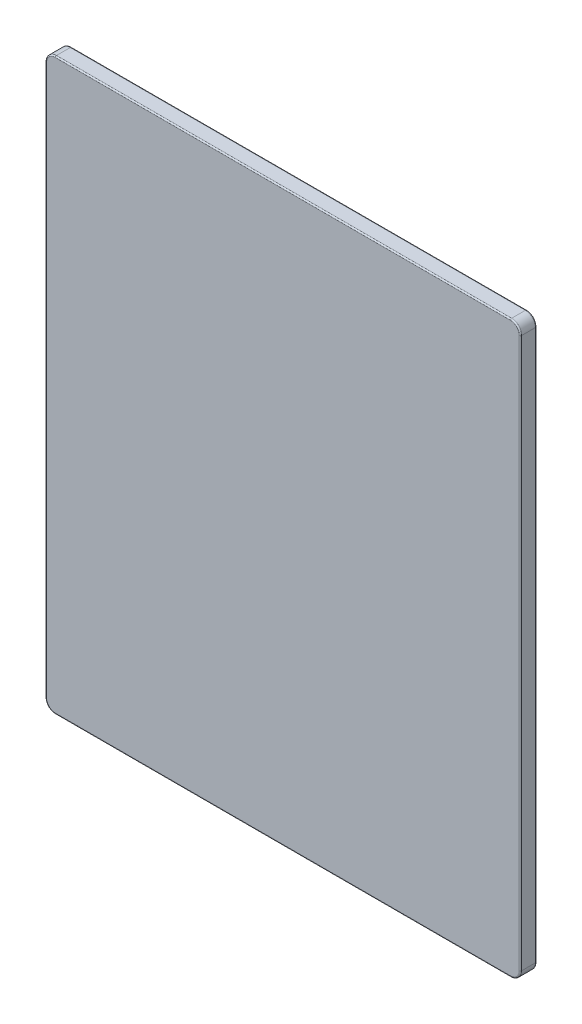
ISO-10303-21;
HEADER;
FILE_DESCRIPTION(('STEP AP214'),'2;1');
FILE_NAME('part.step','',(''),(''),'','','');
FILE_SCHEMA(('AUTOMOTIVE_DESIGN { 1 0 10303 214 1 1 1 1 }'));
ENDSEC;
DATA;
#1=APPLICATION_CONTEXT('core data for automotive mechanical design processes');
#2=APPLICATION_PROTOCOL_DEFINITION('international standard','automotive_design',2000,#1);
#3=PRODUCT_CONTEXT('',#1,'mechanical');
#4=PRODUCT('Part','Part','',(#3));
#5=PRODUCT_RELATED_PRODUCT_CATEGORY('part','',(#4));
#6=PRODUCT_DEFINITION_FORMATION('','',#4);
#7=PRODUCT_DEFINITION_CONTEXT('part definition',#1,'design');
#8=PRODUCT_DEFINITION('design','',#6,#7);
#9=PRODUCT_DEFINITION_SHAPE('','',#8);
#10=(LENGTH_UNIT() NAMED_UNIT(*) SI_UNIT(.MILLI.,.METRE.));
#11=(NAMED_UNIT(*) PLANE_ANGLE_UNIT() SI_UNIT($,.RADIAN.));
#12=(NAMED_UNIT(*) SI_UNIT($,.STERADIAN.) SOLID_ANGLE_UNIT());
#13=UNCERTAINTY_MEASURE_WITH_UNIT(LENGTH_MEASURE(1.E-05),#10,'distance_accuracy_value','');
#14=(GEOMETRIC_REPRESENTATION_CONTEXT(3) GLOBAL_UNCERTAINTY_ASSIGNED_CONTEXT((#13)) GLOBAL_UNIT_ASSIGNED_CONTEXT((#10,
#11,#12)) REPRESENTATION_CONTEXT('',''));
#15=CARTESIAN_POINT('',(0.,0.,0.));
#16=DIRECTION('',(0.,0.,1.));
#17=DIRECTION('',(1.,0.,0.));
#18=AXIS2_PLACEMENT_3D('',#15,#16,#17);
#19=CARTESIAN_POINT('',(0.,0.,13.));
#20=DIRECTION('',(0.,0.,-1.));
#21=DIRECTION('',(-1.,0.,0.));
#22=AXIS2_PLACEMENT_3D('',#19,#20,#21);
#23=PLANE('',#22);
#24=CARTESIAN_POINT('',(182.5,-220.6,13.));
#25=DIRECTION('',(0.,0.,-1.));
#26=DIRECTION('',(1.,0.,0.));
#27=AXIS2_PLACEMENT_3D('',#24,#25,#26);
#28=CIRCLE('',#27,7.00000000000001);
#29=CARTESIAN_POINT('',(189.5,-220.6,13.));
#30=VERTEX_POINT('',#29);
#31=CARTESIAN_POINT('',(182.5,-227.6,13.));
#32=VERTEX_POINT('',#31);
#33=EDGE_CURVE('E210',#30,#32,#28,.T.);
#34=ORIENTED_EDGE('',*,*,#33,.F.);
#35=DIRECTION('',(0.,1.,0.));
#36=VECTOR('',#35,1.);
#37=CARTESIAN_POINT('',(189.5,0.,13.));
#38=LINE('',#37,#36);
#39=CARTESIAN_POINT('',(189.5,220.6,13.));
#40=VERTEX_POINT('',#39);
#41=EDGE_CURVE('E234',#40,#30,#38,.F.);
#42=ORIENTED_EDGE('',*,*,#41,.F.);
#43=CARTESIAN_POINT('',(182.5,220.6,13.));
#44=DIRECTION('',(0.,0.,-1.));
#45=DIRECTION('',(0.,1.,0.));
#46=AXIS2_PLACEMENT_3D('',#43,#44,#45);
#47=CIRCLE('',#46,7.00000000000001);
#48=CARTESIAN_POINT('',(182.5,227.6,13.));
#49=VERTEX_POINT('',#48);
#50=EDGE_CURVE('E247',#49,#40,#47,.T.);
#51=ORIENTED_EDGE('',*,*,#50,.F.);
#52=DIRECTION('',(-1.,0.,0.));
#53=VECTOR('',#52,1.);
#54=CARTESIAN_POINT('',(0.,227.6,13.));
#55=LINE('',#54,#53);
#56=CARTESIAN_POINT('',(-182.5,227.6,13.));
#57=VERTEX_POINT('',#56);
#58=EDGE_CURVE('E145',#57,#49,#55,.F.);
#59=ORIENTED_EDGE('',*,*,#58,.F.);
#60=CARTESIAN_POINT('',(-182.5,220.6,13.));
#61=DIRECTION('',(0.,0.,-1.));
#62=DIRECTION('',(-1.,0.,0.));
#63=AXIS2_PLACEMENT_3D('',#60,#61,#62);
#64=CIRCLE('',#63,7.00000000000001);
#65=CARTESIAN_POINT('',(-189.5,220.6,13.));
#66=VERTEX_POINT('',#65);
#67=EDGE_CURVE('E141',#66,#57,#64,.T.);
#68=ORIENTED_EDGE('',*,*,#67,.F.);
#69=DIRECTION('',(0.,-1.,0.));
#70=VECTOR('',#69,1.);
#71=CARTESIAN_POINT('',(-189.5,0.,13.));
#72=LINE('',#71,#70);
#73=CARTESIAN_POINT('',(-189.5,-220.6,13.));
#74=VERTEX_POINT('',#73);
#75=EDGE_CURVE('E128',#74,#66,#72,.F.);
#76=ORIENTED_EDGE('',*,*,#75,.F.);
#77=CARTESIAN_POINT('',(-182.5,-220.6,13.));
#78=DIRECTION('',(0.,0.,-1.));
#79=DIRECTION('',(0.,-1.,0.));
#80=AXIS2_PLACEMENT_3D('',#77,#78,#79);
#81=CIRCLE('',#80,7.00000000000001);
#82=CARTESIAN_POINT('',(-182.5,-227.6,13.));
#83=VERTEX_POINT('',#82);
#84=EDGE_CURVE('E164',#83,#74,#81,.T.);
#85=ORIENTED_EDGE('',*,*,#84,.F.);
#86=DIRECTION('',(1.,0.,0.));
#87=VECTOR('',#86,1.);
#88=CARTESIAN_POINT('',(0.,-227.6,13.));
#89=LINE('',#88,#87);
#90=EDGE_CURVE('E173',#32,#83,#89,.F.);
#91=ORIENTED_EDGE('',*,*,#90,.F.);
#92=EDGE_LOOP('',(#34,#42,#51,#59,#68,#76,#85,#91));
#93=FACE_BOUND('',#92,.T.);
#94=ADVANCED_FACE('F16',(#93),#23,.F.);
#95=CARTESIAN_POINT('',(-189.5,0.,12.));
#96=DIRECTION('',(0.,-1.,0.));
#97=DIRECTION('',(0.,0.,-1.));
#98=AXIS2_PLACEMENT_3D('',#95,#96,#97);
#99=CYLINDRICAL_SURFACE('',#98,1.);
#100=CARTESIAN_POINT('',(-189.5,-220.6,12.));
#101=DIRECTION('',(0.,1.,0.));
#102=DIRECTION('',(-1.,0.,0.));
#103=AXIS2_PLACEMENT_3D('',#100,#101,#102);
#104=CIRCLE('',#103,1.);
#105=CARTESIAN_POINT('',(-190.5,-220.6,12.));
#106=VERTEX_POINT('',#105);
#107=EDGE_CURVE('E135',#74,#106,#104,.F.);
#108=ORIENTED_EDGE('',*,*,#107,.F.);
#109=ORIENTED_EDGE('',*,*,#75,.T.);
#110=CARTESIAN_POINT('',(-189.5,220.6,12.));
#111=DIRECTION('',(0.,1.,0.));
#112=DIRECTION('',(-1.,0.,0.));
#113=AXIS2_PLACEMENT_3D('',#110,#111,#112);
#114=CIRCLE('',#113,1.);
#115=CARTESIAN_POINT('',(-190.5,220.6,12.));
#116=VERTEX_POINT('',#115);
#117=EDGE_CURVE('E132',#116,#66,#114,.T.);
#118=ORIENTED_EDGE('',*,*,#117,.F.);
#119=DIRECTION('',(0.,1.,0.));
#120=VECTOR('',#119,1.);
#121=CARTESIAN_POINT('',(-190.5,-228.6,12.));
#122=LINE('',#121,#120);
#123=EDGE_CURVE('E177',#116,#106,#122,.F.);
#124=ORIENTED_EDGE('',*,*,#123,.T.);
#125=EDGE_LOOP('',(#108,#109,#118,#124));
#126=FACE_BOUND('',#125,.T.);
#127=ADVANCED_FACE('F130',(#126),#99,.T.);
#128=CARTESIAN_POINT('',(-182.5,220.6,12.));
#129=DIRECTION('',(0.,0.,-1.));
#130=DIRECTION('',(-1.,0.,0.));
#131=AXIS2_PLACEMENT_3D('',#128,#129,#130);
#132=TOROIDAL_SURFACE('',#131,7.00000000000001,1.);
#133=ORIENTED_EDGE('',*,*,#117,.T.);
#134=ORIENTED_EDGE('',*,*,#67,.T.);
#135=CARTESIAN_POINT('',(-182.5,227.6,12.));
#136=DIRECTION('',(-1.,0.,0.));
#137=DIRECTION('',(0.,0.,1.));
#138=AXIS2_PLACEMENT_3D('',#135,#136,#137);
#139=CIRCLE('',#138,1.);
#140=CARTESIAN_POINT('',(-182.5,228.6,12.));
#141=VERTEX_POINT('',#140);
#142=EDGE_CURVE('E148',#141,#57,#139,.F.);
#143=ORIENTED_EDGE('',*,*,#142,.F.);
#144=CARTESIAN_POINT('',(-182.5,220.6,12.));
#145=DIRECTION('',(0.,0.,-1.));
#146=DIRECTION('',(-1.,0.,0.));
#147=AXIS2_PLACEMENT_3D('',#144,#145,#146);
#148=CIRCLE('',#147,8.00000000000001);
#149=EDGE_CURVE('E154',#116,#141,#148,.T.);
#150=ORIENTED_EDGE('',*,*,#149,.F.);
#151=EDGE_LOOP('',(#133,#134,#143,#150));
#152=FACE_BOUND('',#151,.T.);
#153=ADVANCED_FACE('F152',(#152),#132,.T.);
#154=CARTESIAN_POINT('',(0.,227.6,12.));
#155=DIRECTION('',(-1.,0.,0.));
#156=DIRECTION('',(0.,0.,1.));
#157=AXIS2_PLACEMENT_3D('',#154,#155,#156);
#158=CYLINDRICAL_SURFACE('',#157,1.);
#159=CARTESIAN_POINT('',(182.5,227.6,12.));
#160=DIRECTION('',(1.,0.,0.));
#161=DIRECTION('',(0.,1.,0.));
#162=AXIS2_PLACEMENT_3D('',#159,#160,#161);
#163=CIRCLE('',#162,1.);
#164=CARTESIAN_POINT('',(182.5,228.6,12.));
#165=VERTEX_POINT('',#164);
#166=EDGE_CURVE('E269',#165,#49,#163,.T.);
#167=ORIENTED_EDGE('',*,*,#166,.F.);
#168=DIRECTION('',(1.,0.,0.));
#169=VECTOR('',#168,1.);
#170=CARTESIAN_POINT('',(-190.5,228.6,12.));
#171=LINE('',#170,#169);
#172=EDGE_CURVE('E273',#165,#141,#171,.F.);
#173=ORIENTED_EDGE('',*,*,#172,.T.);
#174=ORIENTED_EDGE('',*,*,#142,.T.);
#175=ORIENTED_EDGE('',*,*,#58,.T.);
#176=EDGE_LOOP('',(#167,#173,#174,#175));
#177=FACE_BOUND('',#176,.T.);
#178=ADVANCED_FACE('F263',(#177),#158,.T.);
#179=CARTESIAN_POINT('',(182.5,220.6,12.));
#180=DIRECTION('',(0.,0.,-1.));
#181=DIRECTION('',(-1.,0.,0.));
#182=AXIS2_PLACEMENT_3D('',#179,#180,#181);
#183=TOROIDAL_SURFACE('',#182,7.00000000000001,1.);
#184=CARTESIAN_POINT('',(189.5,220.6,12.));
#185=DIRECTION('',(0.,1.,0.));
#186=DIRECTION('',(0.,0.,1.));
#187=AXIS2_PLACEMENT_3D('',#184,#185,#186);
#188=CIRCLE('',#187,1.);
#189=CARTESIAN_POINT('',(190.5,220.6,12.));
#190=VERTEX_POINT('',#189);
#191=EDGE_CURVE('E241',#190,#40,#188,.F.);
#192=ORIENTED_EDGE('',*,*,#191,.F.);
#193=CARTESIAN_POINT('',(182.5,220.6,12.));
#194=DIRECTION('',(0.,0.,-1.));
#195=DIRECTION('',(-1.,0.,0.));
#196=AXIS2_PLACEMENT_3D('',#193,#194,#195);
#197=CIRCLE('',#196,8.00000000000001);
#198=EDGE_CURVE('E290',#165,#190,#197,.T.);
#199=ORIENTED_EDGE('',*,*,#198,.F.);
#200=ORIENTED_EDGE('',*,*,#166,.T.);
#201=ORIENTED_EDGE('',*,*,#50,.T.);
#202=EDGE_LOOP('',(#192,#199,#200,#201));
#203=FACE_BOUND('',#202,.T.);
#204=ADVANCED_FACE('F253',(#203),#183,.T.);
#205=CARTESIAN_POINT('',(189.5,0.,12.));
#206=DIRECTION('',(0.,1.,0.));
#207=DIRECTION('',(0.,0.,1.));
#208=AXIS2_PLACEMENT_3D('',#205,#206,#207);
#209=CYLINDRICAL_SURFACE('',#208,1.);
#210=CARTESIAN_POINT('',(189.5,-220.6,12.));
#211=DIRECTION('',(0.,-1.,0.));
#212=DIRECTION('',(1.,0.,0.));
#213=AXIS2_PLACEMENT_3D('',#210,#211,#212);
#214=CIRCLE('',#213,1.);
#215=CARTESIAN_POINT('',(190.5,-220.6,12.));
#216=VERTEX_POINT('',#215);
#217=EDGE_CURVE('E215',#216,#30,#214,.T.);
#218=ORIENTED_EDGE('',*,*,#217,.F.);
#219=DIRECTION('',(0.,1.,0.));
#220=VECTOR('',#219,1.);
#221=CARTESIAN_POINT('',(190.5,-228.6,12.));
#222=LINE('',#221,#220);
#223=EDGE_CURVE('E295',#216,#190,#222,.T.);
#224=ORIENTED_EDGE('',*,*,#223,.T.);
#225=ORIENTED_EDGE('',*,*,#191,.T.);
#226=ORIENTED_EDGE('',*,*,#41,.T.);
#227=EDGE_LOOP('',(#218,#224,#225,#226));
#228=FACE_BOUND('',#227,.T.);
#229=ADVANCED_FACE('F224',(#228),#209,.T.);
#230=CARTESIAN_POINT('',(182.5,-220.6,12.));
#231=DIRECTION('',(0.,0.,-1.));
#232=DIRECTION('',(-1.,0.,0.));
#233=AXIS2_PLACEMENT_3D('',#230,#231,#232);
#234=TOROIDAL_SURFACE('',#233,7.00000000000001,1.);
#235=ORIENTED_EDGE('',*,*,#217,.T.);
#236=ORIENTED_EDGE('',*,*,#33,.T.);
#237=CARTESIAN_POINT('',(182.5,-227.6,12.));
#238=DIRECTION('',(1.,0.,0.));
#239=DIRECTION('',(0.,0.,-1.));
#240=AXIS2_PLACEMENT_3D('',#237,#238,#239);
#241=CIRCLE('',#240,1.);
#242=CARTESIAN_POINT('',(182.5,-228.6,12.));
#243=VERTEX_POINT('',#242);
#244=EDGE_CURVE('E208',#243,#32,#241,.F.);
#245=ORIENTED_EDGE('',*,*,#244,.F.);
#246=CARTESIAN_POINT('',(182.5,-220.6,12.));
#247=DIRECTION('',(0.,0.,-1.));
#248=DIRECTION('',(-1.,0.,0.));
#249=AXIS2_PLACEMENT_3D('',#246,#247,#248);
#250=CIRCLE('',#249,8.00000000000001);
#251=EDGE_CURVE('E201',#216,#243,#250,.T.);
#252=ORIENTED_EDGE('',*,*,#251,.F.);
#253=EDGE_LOOP('',(#235,#236,#245,#252));
#254=FACE_BOUND('',#253,.T.);
#255=ADVANCED_FACE('F218',(#254),#234,.T.);
#256=CARTESIAN_POINT('',(0.,-227.6,12.));
#257=DIRECTION('',(1.,0.,0.));
#258=DIRECTION('',(0.,0.,-1.));
#259=AXIS2_PLACEMENT_3D('',#256,#257,#258);
#260=CYLINDRICAL_SURFACE('',#259,1.);
#261=ORIENTED_EDGE('',*,*,#244,.T.);
#262=ORIENTED_EDGE('',*,*,#90,.T.);
#263=CARTESIAN_POINT('',(-182.5,-227.6,12.));
#264=DIRECTION('',(-1.,0.,0.));
#265=DIRECTION('',(0.,-1.,0.));
#266=AXIS2_PLACEMENT_3D('',#263,#264,#265);
#267=CIRCLE('',#266,1.);
#268=CARTESIAN_POINT('',(-182.5,-228.6,12.));
#269=VERTEX_POINT('',#268);
#270=EDGE_CURVE('E178',#269,#83,#267,.T.);
#271=ORIENTED_EDGE('',*,*,#270,.F.);
#272=DIRECTION('',(1.,0.,0.));
#273=VECTOR('',#272,1.);
#274=CARTESIAN_POINT('',(-190.5,-228.6,12.));
#275=LINE('',#274,#273);
#276=EDGE_CURVE('E204',#269,#243,#275,.T.);
#277=ORIENTED_EDGE('',*,*,#276,.T.);
#278=EDGE_LOOP('',(#261,#262,#271,#277));
#279=FACE_BOUND('',#278,.T.);
#280=ADVANCED_FACE('F223',(#279),#260,.T.);
#281=CARTESIAN_POINT('',(-182.5,-220.6,12.));
#282=DIRECTION('',(0.,0.,-1.));
#283=DIRECTION('',(-1.,0.,0.));
#284=AXIS2_PLACEMENT_3D('',#281,#282,#283);
#285=TOROIDAL_SURFACE('',#284,7.00000000000001,1.);
#286=ORIENTED_EDGE('',*,*,#270,.T.);
#287=ORIENTED_EDGE('',*,*,#84,.T.);
#288=ORIENTED_EDGE('',*,*,#107,.T.);
#289=CARTESIAN_POINT('',(-182.5,-220.6,12.));
#290=DIRECTION('',(0.,0.,-1.));
#291=DIRECTION('',(-1.,0.,0.));
#292=AXIS2_PLACEMENT_3D('',#289,#290,#291);
#293=CIRCLE('',#292,8.00000000000001);
#294=EDGE_CURVE('E182',#269,#106,#293,.T.);
#295=ORIENTED_EDGE('',*,*,#294,.F.);
#296=EDGE_LOOP('',(#286,#287,#288,#295));
#297=FACE_BOUND('',#296,.T.);
#298=ADVANCED_FACE('F180',(#297),#285,.T.);
#299=CARTESIAN_POINT('',(-190.5,-228.6,13.));
#300=DIRECTION('',(1.,0.,0.));
#301=DIRECTION('',(0.,0.,-1.));
#302=AXIS2_PLACEMENT_3D('',#299,#300,#301);
#303=PLANE('',#302);
#304=DIRECTION('',(0.,1.,0.));
#305=VECTOR('',#304,1.);
#306=CARTESIAN_POINT('',(-190.5,-228.6,0.999999999999999));
#307=LINE('',#306,#305);
#308=CARTESIAN_POINT('',(-190.5,-220.6,0.999999999999999));
#309=VERTEX_POINT('',#308);
#310=CARTESIAN_POINT('',(-190.5,220.6,0.999999999999999));
#311=VERTEX_POINT('',#310);
#312=EDGE_CURVE('E433',#309,#311,#307,.T.);
#313=ORIENTED_EDGE('',*,*,#312,.F.);
#314=DIRECTION('',(0.,0.,-1.));
#315=VECTOR('',#314,1.);
#316=CARTESIAN_POINT('',(-190.5,-220.6,13.));
#317=LINE('',#316,#315);
#318=EDGE_CURVE('E446',#106,#309,#317,.T.);
#319=ORIENTED_EDGE('',*,*,#318,.F.);
#320=ORIENTED_EDGE('',*,*,#123,.F.);
#321=DIRECTION('',(0.,0.,-1.));
#322=VECTOR('',#321,1.);
#323=CARTESIAN_POINT('',(-190.5,220.6,13.));
#324=LINE('',#323,#322);
#325=EDGE_CURVE('E196',#311,#116,#324,.F.);
#326=ORIENTED_EDGE('',*,*,#325,.F.);
#327=EDGE_LOOP('',(#313,#319,#320,#326));
#328=FACE_BOUND('',#327,.T.);
#329=ADVANCED_FACE('F337',(#328),#303,.F.);
#330=CARTESIAN_POINT('',(-182.5,220.6,13.));
#331=DIRECTION('',(0.,0.,-1.));
#332=DIRECTION('',(-1.,0.,0.));
#333=AXIS2_PLACEMENT_3D('',#330,#331,#332);
#334=CYLINDRICAL_SURFACE('',#333,8.00000000000001);
#335=ORIENTED_EDGE('',*,*,#325,.T.);
#336=ORIENTED_EDGE('',*,*,#149,.T.);
#337=DIRECTION('',(0.,0.,-1.));
#338=VECTOR('',#337,1.);
#339=CARTESIAN_POINT('',(-182.5,228.6,13.));
#340=LINE('',#339,#338);
#341=CARTESIAN_POINT('',(-182.5,228.6,0.999999999999999));
#342=VERTEX_POINT('',#341);
#343=EDGE_CURVE('E276',#141,#342,#340,.T.);
#344=ORIENTED_EDGE('',*,*,#343,.T.);
#345=CARTESIAN_POINT('',(-182.5,220.6,0.999999999999999));
#346=DIRECTION('',(0.,0.,-1.));
#347=DIRECTION('',(-1.,0.,0.));
#348=AXIS2_PLACEMENT_3D('',#345,#346,#347);
#349=CIRCLE('',#348,8.00000000000001);
#350=EDGE_CURVE('E322',#311,#342,#349,.T.);
#351=ORIENTED_EDGE('',*,*,#350,.F.);
#352=EDGE_LOOP('',(#335,#336,#344,#351));
#353=FACE_BOUND('',#352,.T.);
#354=ADVANCED_FACE('F603',(#353),#334,.T.);
#355=CARTESIAN_POINT('',(-190.5,228.6,13.));
#356=DIRECTION('',(0.,-1.,0.));
#357=DIRECTION('',(0.,0.,-1.));
#358=AXIS2_PLACEMENT_3D('',#355,#356,#357);
#359=PLANE('',#358);
#360=DIRECTION('',(1.,0.,0.));
#361=VECTOR('',#360,1.);
#362=CARTESIAN_POINT('',(-190.5,228.6,0.999999999999999));
#363=LINE('',#362,#361);
#364=CARTESIAN_POINT('',(182.5,228.6,0.999999999999999));
#365=VERTEX_POINT('',#364);
#366=EDGE_CURVE('E314',#342,#365,#363,.T.);
#367=ORIENTED_EDGE('',*,*,#366,.F.);
#368=ORIENTED_EDGE('',*,*,#343,.F.);
#369=ORIENTED_EDGE('',*,*,#172,.F.);
#370=DIRECTION('',(0.,0.,-1.));
#371=VECTOR('',#370,1.);
#372=CARTESIAN_POINT('',(182.5,228.6,13.));
#373=LINE('',#372,#371);
#374=EDGE_CURVE('E296',#365,#165,#373,.F.);
#375=ORIENTED_EDGE('',*,*,#374,.F.);
#376=EDGE_LOOP('',(#367,#368,#369,#375));
#377=FACE_BOUND('',#376,.T.);
#378=ADVANCED_FACE('F601',(#377),#359,.F.);
#379=CARTESIAN_POINT('',(182.5,220.6,13.));
#380=DIRECTION('',(0.,0.,-1.));
#381=DIRECTION('',(-1.,0.,0.));
#382=AXIS2_PLACEMENT_3D('',#379,#380,#381);
#383=CYLINDRICAL_SURFACE('',#382,8.00000000000001);
#384=ORIENTED_EDGE('',*,*,#374,.T.);
#385=ORIENTED_EDGE('',*,*,#198,.T.);
#386=DIRECTION('',(0.,0.,1.));
#387=VECTOR('',#386,1.);
#388=CARTESIAN_POINT('',(190.5,220.6,13.));
#389=LINE('',#388,#387);
#390=CARTESIAN_POINT('',(190.5,220.6,0.999999999999999));
#391=VERTEX_POINT('',#390);
#392=EDGE_CURVE('E376',#190,#391,#389,.F.);
#393=ORIENTED_EDGE('',*,*,#392,.T.);
#394=CARTESIAN_POINT('',(182.5,220.6,0.999999999999999));
#395=DIRECTION('',(0.,0.,-1.));
#396=DIRECTION('',(-1.,0.,0.));
#397=AXIS2_PLACEMENT_3D('',#394,#395,#396);
#398=CIRCLE('',#397,8.00000000000001);
#399=EDGE_CURVE('E301',#365,#391,#398,.T.);
#400=ORIENTED_EDGE('',*,*,#399,.F.);
#401=EDGE_LOOP('',(#384,#385,#393,#400));
#402=FACE_BOUND('',#401,.T.);
#403=ADVANCED_FACE('F299',(#402),#383,.T.);
#404=CARTESIAN_POINT('',(190.5,-228.6,13.));
#405=DIRECTION('',(-1.,0.,0.));
#406=DIRECTION('',(0.,0.,1.));
#407=AXIS2_PLACEMENT_3D('',#404,#405,#406);
#408=PLANE('',#407);
#409=DIRECTION('',(0.,-1.,0.));
#410=VECTOR('',#409,1.);
#411=CARTESIAN_POINT('',(190.5,-228.6,0.999999999999999));
#412=LINE('',#411,#410);
#413=CARTESIAN_POINT('',(190.5,-220.6,0.999999999999999));
#414=VERTEX_POINT('',#413);
#415=EDGE_CURVE('E393',#391,#414,#412,.T.);
#416=ORIENTED_EDGE('',*,*,#415,.F.);
#417=ORIENTED_EDGE('',*,*,#392,.F.);
#418=ORIENTED_EDGE('',*,*,#223,.F.);
#419=DIRECTION('',(0.,0.,-1.));
#420=VECTOR('',#419,1.);
#421=CARTESIAN_POINT('',(190.5,-220.6,13.));
#422=LINE('',#421,#420);
#423=EDGE_CURVE('E205',#414,#216,#422,.F.);
#424=ORIENTED_EDGE('',*,*,#423,.F.);
#425=EDGE_LOOP('',(#416,#417,#418,#424));
#426=FACE_BOUND('',#425,.T.);
#427=ADVANCED_FACE('F374',(#426),#408,.F.);
#428=CARTESIAN_POINT('',(182.5,-220.6,13.));
#429=DIRECTION('',(0.,0.,-1.));
#430=DIRECTION('',(-1.,0.,0.));
#431=AXIS2_PLACEMENT_3D('',#428,#429,#430);
#432=CYLINDRICAL_SURFACE('',#431,8.00000000000001);
#433=ORIENTED_EDGE('',*,*,#423,.T.);
#434=ORIENTED_EDGE('',*,*,#251,.T.);
#435=DIRECTION('',(0.,0.,1.));
#436=VECTOR('',#435,1.);
#437=CARTESIAN_POINT('',(182.5,-228.6,13.));
#438=LINE('',#437,#436);
#439=CARTESIAN_POINT('',(182.5,-228.6,0.999999999999999));
#440=VERTEX_POINT('',#439);
#441=EDGE_CURVE('E450',#243,#440,#438,.F.);
#442=ORIENTED_EDGE('',*,*,#441,.T.);
#443=CARTESIAN_POINT('',(182.5,-220.6,0.999999999999999));
#444=DIRECTION('',(0.,0.,-1.));
#445=DIRECTION('',(-1.,0.,0.));
#446=AXIS2_PLACEMENT_3D('',#443,#444,#445);
#447=CIRCLE('',#446,8.00000000000001);
#448=EDGE_CURVE('E464',#414,#440,#447,.T.);
#449=ORIENTED_EDGE('',*,*,#448,.F.);
#450=EDGE_LOOP('',(#433,#434,#442,#449));
#451=FACE_BOUND('',#450,.T.);
#452=ADVANCED_FACE('F615',(#451),#432,.T.);
#453=CARTESIAN_POINT('',(-190.5,-228.6,13.));
#454=DIRECTION('',(0.,1.,0.));
#455=DIRECTION('',(0.,0.,1.));
#456=AXIS2_PLACEMENT_3D('',#453,#454,#455);
#457=PLANE('',#456);
#458=DIRECTION('',(-1.,0.,0.));
#459=VECTOR('',#458,1.);
#460=CARTESIAN_POINT('',(-190.5,-228.6,0.999999999999999));
#461=LINE('',#460,#459);
#462=CARTESIAN_POINT('',(-182.5,-228.6,0.999999999999999));
#463=VERTEX_POINT('',#462);
#464=EDGE_CURVE('E456',#440,#463,#461,.T.);
#465=ORIENTED_EDGE('',*,*,#464,.F.);
#466=ORIENTED_EDGE('',*,*,#441,.F.);
#467=ORIENTED_EDGE('',*,*,#276,.F.);
#468=DIRECTION('',(0.,0.,-1.));
#469=VECTOR('',#468,1.);
#470=CARTESIAN_POINT('',(-182.5,-228.6,13.));
#471=LINE('',#470,#469);
#472=EDGE_CURVE('E449',#463,#269,#471,.F.);
#473=ORIENTED_EDGE('',*,*,#472,.F.);
#474=EDGE_LOOP('',(#465,#466,#467,#473));
#475=FACE_BOUND('',#474,.T.);
#476=ADVANCED_FACE('F612',(#475),#457,.F.);
#477=CARTESIAN_POINT('',(-182.5,-220.6,13.));
#478=DIRECTION('',(0.,0.,-1.));
#479=DIRECTION('',(-1.,0.,0.));
#480=AXIS2_PLACEMENT_3D('',#477,#478,#479);
#481=CYLINDRICAL_SURFACE('',#480,8.00000000000001);
#482=ORIENTED_EDGE('',*,*,#472,.T.);
#483=ORIENTED_EDGE('',*,*,#294,.T.);
#484=ORIENTED_EDGE('',*,*,#318,.T.);
#485=CARTESIAN_POINT('',(-182.5,-220.6,0.999999999999999));
#486=DIRECTION('',(0.,0.,-1.));
#487=DIRECTION('',(-1.,0.,0.));
#488=AXIS2_PLACEMENT_3D('',#485,#486,#487);
#489=CIRCLE('',#488,8.00000000000001);
#490=EDGE_CURVE('E440',#463,#309,#489,.T.);
#491=ORIENTED_EDGE('',*,*,#490,.F.);
#492=EDGE_LOOP('',(#482,#483,#484,#491));
#493=FACE_BOUND('',#492,.T.);
#494=ADVANCED_FACE('F609',(#493),#481,.T.);
#495=CARTESIAN_POINT('',(-189.5,-228.6,0.999999999999999));
#496=DIRECTION('',(0.,1.,0.));
#497=DIRECTION('',(0.,0.,1.));
#498=AXIS2_PLACEMENT_3D('',#495,#496,#497);
#499=CYLINDRICAL_SURFACE('',#498,1.);
#500=CARTESIAN_POINT('',(-189.5,220.6,0.999999999999999));
#501=DIRECTION('',(0.,1.,0.));
#502=DIRECTION('',(-1.,0.,0.));
#503=AXIS2_PLACEMENT_3D('',#500,#501,#502);
#504=CIRCLE('',#503,1.);
#505=CARTESIAN_POINT('',(-189.5,220.6,0.));
#506=VERTEX_POINT('',#505);
#507=EDGE_CURVE('E325',#506,#311,#504,.T.);
#508=ORIENTED_EDGE('',*,*,#507,.F.);
#509=DIRECTION('',(0.,1.,0.));
#510=VECTOR('',#509,1.);
#511=CARTESIAN_POINT('',(-189.5,0.,0.));
#512=LINE('',#511,#510);
#513=CARTESIAN_POINT('',(-189.5,-220.6,0.));
#514=VERTEX_POINT('',#513);
#515=EDGE_CURVE('E531',#514,#506,#512,.T.);
#516=ORIENTED_EDGE('',*,*,#515,.F.);
#517=CARTESIAN_POINT('',(-189.5,-220.6,0.999999999999999));
#518=DIRECTION('',(0.,1.,0.));
#519=DIRECTION('',(-1.,0.,0.));
#520=AXIS2_PLACEMENT_3D('',#517,#518,#519);
#521=CIRCLE('',#520,1.);
#522=EDGE_CURVE('E443',#309,#514,#521,.F.);
#523=ORIENTED_EDGE('',*,*,#522,.F.);
#524=ORIENTED_EDGE('',*,*,#312,.T.);
#525=EDGE_LOOP('',(#508,#516,#523,#524));
#526=FACE_BOUND('',#525,.T.);
#527=ADVANCED_FACE('F420',(#526),#499,.T.);
#528=CARTESIAN_POINT('',(-182.5,220.6,0.999999999999999));
#529=DIRECTION('',(0.,0.,-1.));
#530=DIRECTION('',(-1.,0.,0.));
#531=AXIS2_PLACEMENT_3D('',#528,#529,#530);
#532=TOROIDAL_SURFACE('',#531,7.00000000000001,1.);
#533=CARTESIAN_POINT('',(-182.5,227.6,0.999999999999999));
#534=DIRECTION('',(1.,0.,0.));
#535=DIRECTION('',(0.,0.,-1.));
#536=AXIS2_PLACEMENT_3D('',#533,#534,#535);
#537=CIRCLE('',#536,1.);
#538=CARTESIAN_POINT('',(-182.5,227.6,0.));
#539=VERTEX_POINT('',#538);
#540=EDGE_CURVE('E317',#539,#342,#537,.T.);
#541=ORIENTED_EDGE('',*,*,#540,.F.);
#542=CARTESIAN_POINT('',(-182.5,220.6,0.));
#543=DIRECTION('',(0.,0.,1.));
#544=DIRECTION('',(0.,1.,0.));
#545=AXIS2_PLACEMENT_3D('',#542,#543,#544);
#546=CIRCLE('',#545,7.00000000000001);
#547=EDGE_CURVE('E528',#506,#539,#546,.F.);
#548=ORIENTED_EDGE('',*,*,#547,.F.);
#549=ORIENTED_EDGE('',*,*,#507,.T.);
#550=ORIENTED_EDGE('',*,*,#350,.T.);
#551=EDGE_LOOP('',(#541,#548,#549,#550));
#552=FACE_BOUND('',#551,.T.);
#553=ADVANCED_FACE('F414',(#552),#532,.T.);
#554=CARTESIAN_POINT('',(-190.5,227.6,0.999999999999999));
#555=DIRECTION('',(1.,0.,0.));
#556=DIRECTION('',(0.,0.,-1.));
#557=AXIS2_PLACEMENT_3D('',#554,#555,#556);
#558=CYLINDRICAL_SURFACE('',#557,1.);
#559=ORIENTED_EDGE('',*,*,#540,.T.);
#560=ORIENTED_EDGE('',*,*,#366,.T.);
#561=CARTESIAN_POINT('',(182.5,227.6,0.999999999999999));
#562=DIRECTION('',(1.,0.,0.));
#563=DIRECTION('',(0.,1.,0.));
#564=AXIS2_PLACEMENT_3D('',#561,#562,#563);
#565=CIRCLE('',#564,1.);
#566=CARTESIAN_POINT('',(182.5,227.6,0.));
#567=VERTEX_POINT('',#566);
#568=EDGE_CURVE('E316',#567,#365,#565,.T.);
#569=ORIENTED_EDGE('',*,*,#568,.F.);
#570=DIRECTION('',(-1.,0.,0.));
#571=VECTOR('',#570,1.);
#572=CARTESIAN_POINT('',(0.,227.6,0.));
#573=LINE('',#572,#571);
#574=EDGE_CURVE('E520',#539,#567,#573,.F.);
#575=ORIENTED_EDGE('',*,*,#574,.F.);
#576=EDGE_LOOP('',(#559,#560,#569,#575));
#577=FACE_BOUND('',#576,.T.);
#578=ADVANCED_FACE('F419',(#577),#558,.T.);
#579=CARTESIAN_POINT('',(182.5,220.6,0.999999999999999));
#580=DIRECTION('',(0.,0.,-1.));
#581=DIRECTION('',(-1.,0.,0.));
#582=AXIS2_PLACEMENT_3D('',#579,#580,#581);
#583=TOROIDAL_SURFACE('',#582,7.00000000000001,1.);
#584=ORIENTED_EDGE('',*,*,#568,.T.);
#585=ORIENTED_EDGE('',*,*,#399,.T.);
#586=CARTESIAN_POINT('',(189.5,220.6,0.999999999999999));
#587=DIRECTION('',(0.,-1.,0.));
#588=DIRECTION('',(0.,0.,-1.));
#589=AXIS2_PLACEMENT_3D('',#586,#587,#588);
#590=CIRCLE('',#589,1.);
#591=CARTESIAN_POINT('',(189.5,220.6,0.));
#592=VERTEX_POINT('',#591);
#593=EDGE_CURVE('E390',#592,#391,#590,.T.);
#594=ORIENTED_EDGE('',*,*,#593,.F.);
#595=CARTESIAN_POINT('',(182.5,220.6,0.));
#596=DIRECTION('',(0.,0.,1.));
#597=DIRECTION('',(1.,0.,0.));
#598=AXIS2_PLACEMENT_3D('',#595,#596,#597);
#599=CIRCLE('',#598,7.00000000000001);
#600=EDGE_CURVE('E517',#567,#592,#599,.F.);
#601=ORIENTED_EDGE('',*,*,#600,.F.);
#602=EDGE_LOOP('',(#584,#585,#594,#601));
#603=FACE_BOUND('',#602,.T.);
#604=ADVANCED_FACE('F488',(#603),#583,.T.);
#605=CARTESIAN_POINT('',(189.5,-228.6,0.999999999999999));
#606=DIRECTION('',(0.,-1.,0.));
#607=DIRECTION('',(0.,0.,-1.));
#608=AXIS2_PLACEMENT_3D('',#605,#606,#607);
#609=CYLINDRICAL_SURFACE('',#608,1.);
#610=ORIENTED_EDGE('',*,*,#593,.T.);
#611=ORIENTED_EDGE('',*,*,#415,.T.);
#612=CARTESIAN_POINT('',(189.5,-220.6,0.999999999999999));
#613=DIRECTION('',(0.,-1.,0.));
#614=DIRECTION('',(1.,0.,0.));
#615=AXIS2_PLACEMENT_3D('',#612,#613,#614);
#616=CIRCLE('',#615,1.);
#617=CARTESIAN_POINT('',(189.5,-220.6,0.));
#618=VERTEX_POINT('',#617);
#619=EDGE_CURVE('E467',#618,#414,#616,.T.);
#620=ORIENTED_EDGE('',*,*,#619,.F.);
#621=DIRECTION('',(0.,1.,0.));
#622=VECTOR('',#621,1.);
#623=CARTESIAN_POINT('',(189.5,0.,0.));
#624=LINE('',#623,#622);
#625=EDGE_CURVE('E512',#592,#618,#624,.F.);
#626=ORIENTED_EDGE('',*,*,#625,.F.);
#627=EDGE_LOOP('',(#610,#611,#620,#626));
#628=FACE_BOUND('',#627,.T.);
#629=ADVANCED_FACE('F492',(#628),#609,.T.);
#630=CARTESIAN_POINT('',(182.5,-220.6,0.999999999999999));
#631=DIRECTION('',(0.,0.,-1.));
#632=DIRECTION('',(-1.,0.,0.));
#633=AXIS2_PLACEMENT_3D('',#630,#631,#632);
#634=TOROIDAL_SURFACE('',#633,7.00000000000001,1.);
#635=CARTESIAN_POINT('',(182.5,-227.6,0.999999999999999));
#636=DIRECTION('',(-1.,0.,0.));
#637=DIRECTION('',(0.,0.,1.));
#638=AXIS2_PLACEMENT_3D('',#635,#636,#637);
#639=CIRCLE('',#638,1.);
#640=CARTESIAN_POINT('',(182.5,-227.6,0.));
#641=VERTEX_POINT('',#640);
#642=EDGE_CURVE('E458',#641,#440,#639,.T.);
#643=ORIENTED_EDGE('',*,*,#642,.F.);
#644=CARTESIAN_POINT('',(182.5,-220.6,0.));
#645=DIRECTION('',(0.,0.,1.));
#646=DIRECTION('',(0.,-1.,0.));
#647=AXIS2_PLACEMENT_3D('',#644,#645,#646);
#648=CIRCLE('',#647,7.00000000000001);
#649=EDGE_CURVE('E506',#618,#641,#648,.F.);
#650=ORIENTED_EDGE('',*,*,#649,.F.);
#651=ORIENTED_EDGE('',*,*,#619,.T.);
#652=ORIENTED_EDGE('',*,*,#448,.T.);
#653=EDGE_LOOP('',(#643,#650,#651,#652));
#654=FACE_BOUND('',#653,.T.);
#655=ADVANCED_FACE('F494',(#654),#634,.T.);
#656=CARTESIAN_POINT('',(-190.5,-227.6,0.999999999999999));
#657=DIRECTION('',(-1.,0.,0.));
#658=DIRECTION('',(0.,0.,1.));
#659=AXIS2_PLACEMENT_3D('',#656,#657,#658);
#660=CYLINDRICAL_SURFACE('',#659,1.);
#661=CARTESIAN_POINT('',(-182.5,-227.6,0.999999999999999));
#662=DIRECTION('',(-1.,0.,0.));
#663=DIRECTION('',(0.,-1.,0.));
#664=AXIS2_PLACEMENT_3D('',#661,#662,#663);
#665=CIRCLE('',#664,1.);
#666=CARTESIAN_POINT('',(-182.5,-227.6,0.));
#667=VERTEX_POINT('',#666);
#668=EDGE_CURVE('E36',#667,#463,#665,.T.);
#669=ORIENTED_EDGE('',*,*,#668,.F.);
#670=DIRECTION('',(-1.,0.,0.));
#671=VECTOR('',#670,1.);
#672=CARTESIAN_POINT('',(0.,-227.6,0.));
#673=LINE('',#672,#671);
#674=EDGE_CURVE('E28',#641,#667,#673,.T.);
#675=ORIENTED_EDGE('',*,*,#674,.F.);
#676=ORIENTED_EDGE('',*,*,#642,.T.);
#677=ORIENTED_EDGE('',*,*,#464,.T.);
#678=EDGE_LOOP('',(#669,#675,#676,#677));
#679=FACE_BOUND('',#678,.T.);
#680=ADVANCED_FACE('F499',(#679),#660,.T.);
#681=CARTESIAN_POINT('',(-182.5,-220.6,0.999999999999999));
#682=DIRECTION('',(0.,0.,-1.));
#683=DIRECTION('',(-1.,0.,0.));
#684=AXIS2_PLACEMENT_3D('',#681,#682,#683);
#685=TOROIDAL_SURFACE('',#684,7.00000000000001,1.);
#686=ORIENTED_EDGE('',*,*,#522,.T.);
#687=CARTESIAN_POINT('',(-182.5,-220.6,0.));
#688=DIRECTION('',(0.,0.,1.));
#689=DIRECTION('',(-1.,0.,0.));
#690=AXIS2_PLACEMENT_3D('',#687,#688,#689);
#691=CIRCLE('',#690,7.00000000000001);
#692=EDGE_CURVE('E11',#667,#514,#691,.F.);
#693=ORIENTED_EDGE('',*,*,#692,.F.);
#694=ORIENTED_EDGE('',*,*,#668,.T.);
#695=ORIENTED_EDGE('',*,*,#490,.T.);
#696=EDGE_LOOP('',(#686,#693,#694,#695));
#697=FACE_BOUND('',#696,.T.);
#698=ADVANCED_FACE('F539',(#697),#685,.T.);
#699=CARTESIAN_POINT('',(0.,0.,0.));
#700=DIRECTION('',(0.,0.,-1.));
#701=DIRECTION('',(-1.,0.,0.));
#702=AXIS2_PLACEMENT_3D('',#699,#700,#701);
#703=PLANE('',#702);
#704=ORIENTED_EDGE('',*,*,#674,.T.);
#705=ORIENTED_EDGE('',*,*,#692,.T.);
#706=ORIENTED_EDGE('',*,*,#515,.T.);
#707=ORIENTED_EDGE('',*,*,#547,.T.);
#708=ORIENTED_EDGE('',*,*,#574,.T.);
#709=ORIENTED_EDGE('',*,*,#600,.T.);
#710=ORIENTED_EDGE('',*,*,#625,.T.);
#711=ORIENTED_EDGE('',*,*,#649,.T.);
#712=EDGE_LOOP('',(#704,#705,#706,#707,#708,#709,#710,#711));
#713=FACE_BOUND('',#712,.T.);
#714=ADVANCED_FACE('F515',(#713),#703,.T.);
#715=CLOSED_SHELL('',(#94,#127,#153,#178,#204,#229,#255,#280,#298,#329,#354,#378,#403,#427,#452,
#476,#494,#527,#553,#578,#604,#629,#655,#680,#698,#714));
#716=MANIFOLD_SOLID_BREP('B1',#715);
#717=ADVANCED_BREP_SHAPE_REPRESENTATION('',(#18,#716),#14);
#718=SHAPE_DEFINITION_REPRESENTATION(#9,#717);
ENDSEC;
END-ISO-10303-21;
